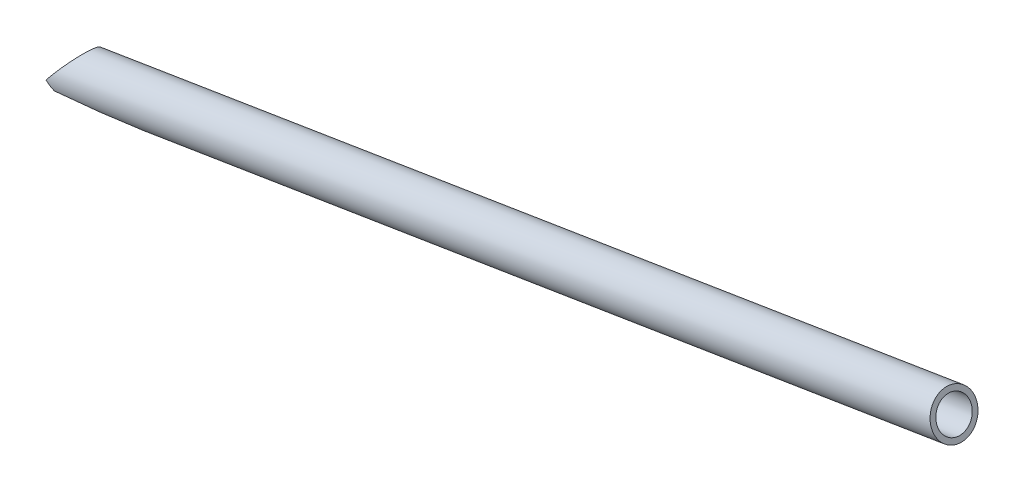
ISO-10303-21;
HEADER;
FILE_DESCRIPTION(('STEP AP214'),'2;1');
FILE_NAME('part.step','',(''),(''),'','','');
FILE_SCHEMA(('AUTOMOTIVE_DESIGN { 1 0 10303 214 1 1 1 1 }'));
ENDSEC;
DATA;
#1=APPLICATION_CONTEXT('core data for automotive mechanical design processes');
#2=APPLICATION_PROTOCOL_DEFINITION('international standard','automotive_design',2000,#1);
#3=PRODUCT_CONTEXT('',#1,'mechanical');
#4=PRODUCT('Part','Part','',(#3));
#5=PRODUCT_RELATED_PRODUCT_CATEGORY('part','',(#4));
#6=PRODUCT_DEFINITION_FORMATION('','',#4);
#7=PRODUCT_DEFINITION_CONTEXT('part definition',#1,'design');
#8=PRODUCT_DEFINITION('design','',#6,#7);
#9=PRODUCT_DEFINITION_SHAPE('','',#8);
#10=(LENGTH_UNIT() NAMED_UNIT(*) SI_UNIT(.MILLI.,.METRE.));
#11=(NAMED_UNIT(*) PLANE_ANGLE_UNIT() SI_UNIT($,.RADIAN.));
#12=(NAMED_UNIT(*) SI_UNIT($,.STERADIAN.) SOLID_ANGLE_UNIT());
#13=UNCERTAINTY_MEASURE_WITH_UNIT(LENGTH_MEASURE(1.E-05),#10,'distance_accuracy_value','');
#14=(GEOMETRIC_REPRESENTATION_CONTEXT(3) GLOBAL_UNCERTAINTY_ASSIGNED_CONTEXT((#13)) GLOBAL_UNIT_ASSIGNED_CONTEXT((#10,
#11,#12)) REPRESENTATION_CONTEXT('',''));
#15=CARTESIAN_POINT('',(0.,0.,0.));
#16=DIRECTION('',(0.,0.,1.));
#17=DIRECTION('',(1.,0.,0.));
#18=AXIS2_PLACEMENT_3D('',#15,#16,#17);
#19=CARTESIAN_POINT('',(1.11022302462516E-13,0.,200.));
#20=DIRECTION('',(0.974346253790714,0.214414809831036,0.0683788494281786));
#21=DIRECTION('',(-0.214917840654041,0.976632132263016,0.));
#22=AXIS2_PLACEMENT_3D('',#19,#20,#21);
#23=CYLINDRICAL_SURFACE('',#22,9.64999999999999);
#24=CARTESIAN_POINT('',(12.657848165168,12.6663837757625,201.033866445705));
#25=CARTESIAN_POINT('',(12.6754852969952,12.670267892202,200.817962669183));
#26=CARTESIAN_POINT('',(12.687592032191,12.6654475263971,200.601479552875));
#27=CARTESIAN_POINT('',(12.7007141875833,12.638523414575,200.169174249629));
#28=CARTESIAN_POINT('',(12.7017259689614,12.6164140008057,199.953352302735));
#29=CARTESIAN_POINT('',(12.6928978972254,12.5553665255426,199.524078278938));
#30=CARTESIAN_POINT('',(12.6830448100684,12.5164079759855,199.310629412783));
#31=CARTESIAN_POINT('',(12.6530021284405,12.4224960842971,198.888058418631));
#32=CARTESIAN_POINT('',(12.6328130614765,12.3675435584958,198.678936070393));
#33=CARTESIAN_POINT('',(12.5830320600362,12.243184894706,198.268006854536));
#34=CARTESIAN_POINT('',(12.5535148210002,12.1738950347901,198.066155597168));
#35=CARTESIAN_POINT('',(12.4858919172012,12.0217614179797,197.669092329484));
#36=CARTESIAN_POINT('',(12.447782977421,11.9389124958994,197.473882883662));
#37=CARTESIAN_POINT('',(12.3219341907085,11.6717883085674,196.89946271389));
#38=CARTESIAN_POINT('',(12.2226442596147,11.468867642128,196.531241749801));
#39=CARTESIAN_POINT('',(12.0316060655805,11.0842553958153,195.925453749268));
#40=CARTESIAN_POINT('',(11.9453209343831,10.91212601697,195.679846866211));
#41=CARTESIAN_POINT('',(11.7633134569783,10.5493905147042,195.206391270707));
#42=CARTESIAN_POINT('',(11.6675910839366,10.3587843387457,194.978542608757));
#43=CARTESIAN_POINT('',(11.4690610515366,9.96101997894277,194.540268125786));
#44=CARTESIAN_POINT('',(11.3662391268434,9.75382832807187,194.329879370938));
#45=CARTESIAN_POINT('',(11.1561166203957,9.32502507307062,193.926888893094));
#46=CARTESIAN_POINT('',(11.0488165553767,9.10341513103559,193.734285126072));
#47=CARTESIAN_POINT('',(10.8289801630034,8.64046845812747,193.361372645541));
#48=CARTESIAN_POINT('',(10.7163820687469,8.39874712577531,193.181578732136));
#49=CARTESIAN_POINT('',(10.4916151560703,7.90231270031796,192.840551125452));
#50=CARTESIAN_POINT('',(10.3794463991996,7.64759781431844,192.67932000358));
#51=CARTESIAN_POINT('',(10.1585685259634,7.12595405745613,192.375783109446));
#52=CARTESIAN_POINT('',(10.0498570573465,6.85903380588485,192.233464250728));
#53=CARTESIAN_POINT('',(9.83922076496434,6.31316264002374,191.968289535191));
#54=CARTESIAN_POINT('',(9.73729399139708,6.03421522043333,191.845428072539));
#55=CARTESIAN_POINT('',(9.57047290019094,5.54167367208223,191.650883437746));
#56=CARTESIAN_POINT('',(9.50303018067841,5.33086341131199,191.57435553236));
#57=CARTESIAN_POINT('',(9.37581635364825,4.90317076918427,191.433023906388));
#58=CARTESIAN_POINT('',(9.31604509781582,4.68628850531749,191.368219959128));
#59=CARTESIAN_POINT('',(9.15160880875329,4.02730802877123,191.192962312236));
#60=CARTESIAN_POINT('',(9.06144948682961,3.57583876087093,191.101244616923));
#61=CARTESIAN_POINT('',(8.97577033685186,2.93201498308204,191.015197637156));
#62=CARTESIAN_POINT('',(8.95588857677276,2.74596800194406,190.995420446076));
#63=CARTESIAN_POINT('',(8.92662025858535,2.37226878285702,190.966401216281));
#64=CARTESIAN_POINT('',(8.91722787463907,2.18461749436526,190.957153329495));
#65=CARTESIAN_POINT('',(8.9097824107179,1.80905100842609,190.949817507622));
#66=CARTESIAN_POINT('',(8.91171782718196,1.6211362723883,190.951718250927));
#67=CARTESIAN_POINT('',(8.92731018355185,1.24625414074607,190.967101487222));
#68=CARTESIAN_POINT('',(8.94096712902547,1.05928674559166,190.980583985713));
#69=CARTESIAN_POINT('',(8.97991455492612,0.687489382956031,191.01936046835));
#70=CARTESIAN_POINT('',(9.00522424573735,0.502663463668033,191.044673957779));
#71=CARTESIAN_POINT('',(9.06681305387757,0.136872736743957,191.10703570765));
#72=CARTESIAN_POINT('',(9.1030922202112,-0.0440920536391802,191.144084020517));
#73=CARTESIAN_POINT('',(9.18555958718107,-0.401254556927476,191.229651059047));
#74=CARTESIAN_POINT('',(9.23176218203105,-0.577444921801709,191.278186457591));
#75=CARTESIAN_POINT('',(9.33263534026653,-0.923960892723459,191.38621015946));
#76=CARTESIAN_POINT('',(9.38730810309086,-1.09428496139519,191.445701308411));
#77=CARTESIAN_POINT('',(9.52087381528293,-1.4782069213988,191.594307053623));
#78=CARTESIAN_POINT('',(9.60213445933264,-1.68961151358125,191.686970030302));
#79=CARTESIAN_POINT('',(9.77298568619439,-2.10101241056311,191.888514167262));
#80=CARTESIAN_POINT('',(9.86257895681247,-2.30100500046087,191.997400567503));
#81=CARTESIAN_POINT('',(10.0471440872052,-2.68964539689294,192.230379286382));
#82=CARTESIAN_POINT('',(10.1421222750033,-2.87827929544429,192.35448970323));
#83=CARTESIAN_POINT('',(10.3346687900217,-3.24398655328794,192.616836779603));
#84=CARTESIAN_POINT('',(10.432236937378,-3.42106071242621,192.755072460068));
#85=CARTESIAN_POINT('',(10.6302469377256,-3.76832748768761,193.048738097051));
#86=CARTESIAN_POINT('',(10.7306961138509,-3.93821118703156,193.204527959343));
#87=CARTESIAN_POINT('',(10.9296761212004,-4.26593746353563,193.529414802733));
#88=CARTESIAN_POINT('',(11.0282069546279,-4.42378005452549,193.698511768547));
#89=CARTESIAN_POINT('',(11.221393921876,-4.72732273014252,194.049334917178));
#90=CARTESIAN_POINT('',(11.3160502341815,-4.87302337442551,194.231060517198));
#91=CARTESIAN_POINT('',(11.4997202170597,-5.15204586566136,194.6064747587));
#92=CARTESIAN_POINT('',(11.5887337870685,-5.28536749201734,194.800163613268));
#93=CARTESIAN_POINT('',(11.7745249052481,-5.56162127137581,195.233914899582));
#94=CARTESIAN_POINT('',(11.8699109411979,-5.70211401694958,195.476138738318));
#95=CARTESIAN_POINT('',(12.048162615045,-5.96464239802318,195.974840419486));
#96=CARTESIAN_POINT('',(12.1310267599506,-6.08667583261123,196.231319956655));
#97=CARTESIAN_POINT('',(12.2819546322827,-6.31124777852025,196.756808713));
#98=CARTESIAN_POINT('',(12.35002236117,-6.41379155957007,197.025814520688));
#99=CARTESIAN_POINT('',(12.4693686655423,-6.59834253262544,197.574386494805));
#100=CARTESIAN_POINT('',(12.5206497605536,-6.68035280609528,197.853951069424));
#101=CARTESIAN_POINT('',(12.6010833501426,-6.81660628665564,198.396496064464));
#102=CARTESIAN_POINT('',(12.6317752082778,-6.87264686504241,198.65879763247));
#103=CARTESIAN_POINT('',(12.6768028120194,-6.96610068542239,199.188093314851));
#104=CARTESIAN_POINT('',(12.6911393670858,-7.00351484922619,199.455087196329));
#105=CARTESIAN_POINT('',(12.7028257800838,-7.05920581180806,199.991257529388));
#106=CARTESIAN_POINT('',(12.7001870149056,-7.07749541834401,200.260432398458));
#107=CARTESIAN_POINT('',(12.6777224541967,-7.09472605759301,200.798676180139));
#108=CARTESIAN_POINT('',(12.6578980603119,-7.09366866808983,201.067745099601));
#109=CARTESIAN_POINT('',(12.6043015208981,-7.07337718559519,201.574620264416));
#110=CARTESIAN_POINT('',(12.5722488163337,-7.05610016870809,201.812690956057));
#111=CARTESIAN_POINT('',(12.4950285866947,-7.0063320831581,202.285064966595));
#112=CARTESIAN_POINT('',(12.4498622194777,-6.97384235753062,202.519368616172));
#113=CARTESIAN_POINT('',(12.3470733567039,-6.89399113972104,202.982629751483));
#114=CARTESIAN_POINT('',(12.2894511612864,-6.84663000587242,203.211587365888));
#115=CARTESIAN_POINT('',(12.1626131988353,-6.73749471041387,203.662752495432));
#116=CARTESIAN_POINT('',(12.0933969981372,-6.67572000964217,203.884959757711));
#117=CARTESIAN_POINT('',(11.9436778465763,-6.53762710135798,204.323513792904));
#118=CARTESIAN_POINT('',(11.8630714479886,-6.46117299157532,204.539782321164));
#119=CARTESIAN_POINT('',(11.692289550137,-6.29471221418746,204.963110304137));
#120=CARTESIAN_POINT('',(11.6021140777158,-6.20470558459893,205.170169784681));
#121=CARTESIAN_POINT('',(11.4134646716672,-6.01169492196573,205.574276913209));
#122=CARTESIAN_POINT('',(11.3149883085275,-5.90868707929612,205.771321602816));
#123=CARTESIAN_POINT('',(11.1111357691073,-5.69022619477957,206.154656715818));
#124=CARTESIAN_POINT('',(11.0057589196984,-5.57477193809845,206.340946086708));
#125=CARTESIAN_POINT('',(10.7777141657784,-5.31856774651254,206.722010309178));
#126=CARTESIAN_POINT('',(10.6544168322438,-5.17643226006651,206.915478172531));
#127=CARTESIAN_POINT('',(10.4032278554856,-4.87788113941168,207.28788763306));
#128=CARTESIAN_POINT('',(10.2753357011349,-4.72146391350242,207.466827606892));
#129=CARTESIAN_POINT('',(10.0171562660308,-4.39453630523217,207.809780975575));
#130=CARTESIAN_POINT('',(9.88686728586113,-4.2240155980851,207.973783247038));
#131=CARTESIAN_POINT('',(9.62652996395328,-3.86910352104385,208.286208382021));
#132=CARTESIAN_POINT('',(9.49648159627687,-3.68471374773046,208.434633034108));
#133=CARTESIAN_POINT('',(9.25361789511525,-3.32302093532176,208.699957780578));
#134=CARTESIAN_POINT('',(9.14047787128656,-3.14716168728862,208.81852989279));
#135=CARTESIAN_POINT('',(8.91901082493826,-2.78429490902679,209.042457426952));
#136=CARTESIAN_POINT('',(8.81068394129518,-2.59728705748459,209.147812467701));
#137=CARTESIAN_POINT('',(8.60171787932793,-2.21240262403463,209.344571447791));
#138=CARTESIAN_POINT('',(8.50106667414862,-2.01454391683933,209.435997446312));
#139=CARTESIAN_POINT('',(8.31033157004587,-1.60787973124984,209.604404048217));
#140=CARTESIAN_POINT('',(8.22024453856257,-1.3990775246041,209.681388937858));
#141=CARTESIAN_POINT('',(8.07219799572401,-1.01814953533025,209.804936372095));
#142=CARTESIAN_POINT('',(8.01152738662136,-0.848036954497815,209.854467253069));
#143=CARTESIAN_POINT('',(7.90019825042097,-0.502123554917211,209.943941452427));
#144=CARTESIAN_POINT('',(7.84953721424909,-0.326324174555271,209.983887174039));
#145=CARTESIAN_POINT('',(7.75968346630133,0.0298789983831765,210.053882904637));
#146=CARTESIAN_POINT('',(7.7204761110397,0.210276588312629,210.083945555312));
#147=CARTESIAN_POINT('',(7.65452056150057,0.574711547408665,210.134102751716));
#148=CARTESIAN_POINT('',(7.62777240264866,0.758748926922818,210.154197269102));
#149=CARTESIAN_POINT('',(7.58729736710546,1.12933701155678,210.184476530198));
#150=CARTESIAN_POINT('',(7.57359003057456,1.31589106480192,210.194646403566));
#151=CARTESIAN_POINT('',(7.55928496846903,1.68976150279357,210.205257868046));
#152=CARTESIAN_POINT('',(7.55868719735125,1.87707788488945,210.205699492955));
#153=CARTESIAN_POINT('',(7.57007812713593,2.25126812774638,210.197252738259));
#154=CARTESIAN_POINT('',(7.58207838098105,2.43814142453817,210.188355794777));
#155=CARTESIAN_POINT('',(7.61773354362025,2.81021036406976,210.161723258219));
#156=CARTESIAN_POINT('',(7.64139531066782,2.99540495419567,210.143982463916));
#157=CARTESIAN_POINT('',(7.71032373626974,3.43413181077307,210.091751442174));
#158=CARTESIAN_POINT('',(7.76040396532063,3.68645830062254,210.053439615003));
#159=CARTESIAN_POINT('',(7.87712333147059,4.1844542800869,209.962247733673));
#160=CARTESIAN_POINT('',(7.94376372615572,4.43012326255573,209.909366573079));
#161=CARTESIAN_POINT('',(8.09048153877835,4.91483857610279,209.789947598085));
#162=CARTESIAN_POINT('',(8.17059998894754,5.15386200490303,209.723367937953));
#163=CARTESIAN_POINT('',(8.34116361501561,5.62413483013557,209.577452321735));
#164=CARTESIAN_POINT('',(8.43160870112228,5.85538429414147,209.498116476565));
#165=CARTESIAN_POINT('',(8.66224985763888,6.41106151823796,209.289197596));
#166=CARTESIAN_POINT('',(8.80669543990857,6.73123636832925,209.152951333516));
#167=CARTESIAN_POINT('',(9.10574976650321,7.35491620776174,208.855499648973));
#168=CARTESIAN_POINT('',(9.26036331945248,7.65841318346253,208.694282368093));
#169=CARTESIAN_POINT('',(9.57466628494203,8.24772414482963,208.34689305478));
#170=CARTESIAN_POINT('',(9.73435274415617,8.53354814371304,208.16073534609));
#171=CARTESIAN_POINT('',(10.0545253322407,9.08619591870411,207.762841654706));
#172=CARTESIAN_POINT('',(10.2150110783647,9.35302799910387,207.551116961846));
#173=CARTESIAN_POINT('',(10.4931035163631,9.80155444800179,207.157339786608));
#174=CARTESIAN_POINT('',(10.611422455241,9.98788573232563,206.981055422251));
#175=CARTESIAN_POINT('',(10.8444945432767,10.3472860038503,206.613194308935));
#176=CARTESIAN_POINT('',(10.9592477346205,10.5203551479894,206.421617740993));
#177=CARTESIAN_POINT('',(11.1831567308115,10.8512977391196,206.02321751645));
#178=CARTESIAN_POINT('',(11.2923203442298,11.0091926707726,205.816416171779));
#179=CARTESIAN_POINT('',(11.5031998383121,11.3079908568909,205.387344787793));
#180=CARTESIAN_POINT('',(11.6049184595258,11.4489003762788,205.165080499853));
#181=CARTESIAN_POINT('',(11.7768359798297,11.6816923565197,204.757456260285));
#182=CARTESIAN_POINT('',(11.8489604874108,11.7774553331454,204.575119144998));
#183=CARTESIAN_POINT('',(11.9863896171809,11.9561724531027,204.201901159135));
#184=CARTESIAN_POINT('',(12.0516980845563,12.0391338310809,204.011025193433));
#185=CARTESIAN_POINT('',(12.1743843772026,12.1909637141055,203.621597467278));
#186=CARTESIAN_POINT('',(12.231773473511,12.2598523164121,203.423057141255));
#187=CARTESIAN_POINT('',(12.3376871344589,12.3824764680831,203.019116826723));
#188=CARTESIAN_POINT('',(12.3862146464146,12.4362170588403,202.813719145917));
#189=CARTESIAN_POINT('',(12.4834127196024,12.5378845454177,202.349994413075));
#190=CARTESIAN_POINT('',(12.5296171657237,12.5817252761047,202.090232671769));
#191=CARTESIAN_POINT('',(12.605966980083,12.6435840389845,201.565230314472));
#192=CARTESIAN_POINT('',(12.6361087155118,12.6615962312443,201.299988473157));
#193=CARTESIAN_POINT('',(12.657848165168,12.6663837757625,201.033866445705));
#194=B_SPLINE_CURVE_WITH_KNOTS('',3,(#24,#25,#26,#27,#28,#29,#30,#31,#32,#33,#34,#35,#36,#37,
#38,#39,#40,#41,#42,#43,#44,#45,#46,#47,#48,#49,#50,#51,#52,#53,#54,#55,#56,#57,#58,#59,#60,#61,
#62,#63,#64,#65,#66,#67,#68,#69,#70,#71,#72,#73,#74,#75,#76,#77,#78,#79,#80,#81,#82,#83,#84,#85,
#86,#87,#88,#89,#90,#91,#92,#93,#94,#95,#96,#97,#98,#99,#100,#101,#102,#103,#104,#105,#106,#107,
#108,#109,#110,#111,#112,#113,#114,#115,#116,#117,#118,#119,#120,#121,#122,#123,#124,#125,#126,
#127,#128,#129,#130,#131,#132,#133,#134,#135,#136,#137,#138,#139,#140,#141,#142,#143,#144,#145,
#146,#147,#148,#149,#150,#151,#152,#153,#154,#155,#156,#157,#158,#159,#160,#161,#162,#163,#164,
#165,#166,#167,#168,#169,#170,#171,#172,#173,#174,#175,#176,#177,#178,#179,#180,#181,#182,#183,
#184,#185,#186,#187,#188,#189,#190,#191,#192,#193),.UNSPECIFIED.,.T.,.F.,(4,2,2,2,2,2,2,2,2,2,2,
2,2,2,2,2,2,2,2,2,2,2,2,2,2,2,2,2,2,2,2,2,2,2,2,2,2,2,2,2,2,2,2,2,2,2,2,2,2,2,2,2,2,2,2,2,2,2,2,
2,2,2,2,2,2,2,2,2,2,2,2,2,2,2,2,2,2,2,2,2,2,2,2,2,4),(0.,0.649678992547228,1.29957105431823,
1.95025559778301,2.60090693623045,3.24647484049866,3.8922892421184,5.18323403228391,
6.11839408192941,7.05355679074251,7.99065653809302,8.92764845027619,9.89166374666569,
10.8558124228479,11.8192904374071,12.7824903591283,13.4845685095807,14.1866330844921,
15.5872517432656,16.1512443575714,16.7149235722867,17.2780304612016,17.8411376175953,
18.4051764388978,18.9692177800052,19.5340828721208,20.0990948887177,20.8321251409705,
21.5653926679852,22.2995405038224,23.0336374882595,23.7872874320547,24.5409365102368,
25.2945508314175,26.048178579598,26.9344668093368,27.820860628459,28.7070144371056,
29.5930351807991,30.4018162261614,31.2105572414324,32.0187562935107,32.8268894357359,
33.5485495749332,34.2701460152548,34.9917250697092,35.7133311202733,36.4419715064427,
37.1706098487146,37.8994621949661,38.6283857454848,39.4371826220439,40.2460697493337,
41.0555543738144,41.8649459541521,42.5854928993547,43.3060606214649,44.0254750579606,
44.744675626512,45.3059654547501,45.8671144068969,46.4275427606506,46.9879727078769,
47.5492410779597,48.1105074981735,48.6722890743507,49.2344014349021,50.0134203547476,
50.7924984517109,51.5739927599809,52.3554802735155,53.4842022198906,54.6134618530179,
55.7420756899369,56.8701929650849,57.7169724226869,58.5637418583223,59.4092941505477,
60.2545336075759,60.9086048036489,61.5623049958734,62.2150650133965,62.8676075293849,
63.6682179517075,64.4690093666343),.UNSPECIFIED.);
#195=CARTESIAN_POINT('',(12.1046465312167,12.1046465312168,203.842854714181));
#196=VERTEX_POINT('',#195);
#197=CARTESIAN_POINT('',(12.6676672933684,12.6676672933683,200.905651889264));
#198=VERTEX_POINT('',#197);
#199=EDGE_CURVE('E118',#196,#198,#194,.T.);
#200=ORIENTED_EDGE('',*,*,#199,.T.);
#201=CARTESIAN_POINT('',(12.620043989875,12.6580645822266,201.031213378585));
#202=CARTESIAN_POINT('',(12.7011049108782,12.6759016546251,200.812254118165));
#203=CARTESIAN_POINT('',(12.7914335437327,12.687769201916,200.596224647645));
#204=CARTESIAN_POINT('',(12.9898665766632,12.70060598483,200.172153765622));
#205=CARTESIAN_POINT('',(13.0979731689363,12.7015738753942,199.964113343154));
#206=CARTESIAN_POINT('',(13.3310116553986,12.6939256763454,199.557762682774));
#207=CARTESIAN_POINT('',(13.4559511701165,12.6853052330426,199.359456907692));
#208=CARTESIAN_POINT('',(13.7213853969213,12.6599718973868,198.974131623141));
#209=CARTESIAN_POINT('',(13.8618798377827,12.6432591461194,198.787111916967));
#210=CARTESIAN_POINT('',(14.1558258223762,12.6034798585235,198.42682068598));
#211=CARTESIAN_POINT('',(14.3091643981065,12.5804653612168,198.253450919068));
#212=CARTESIAN_POINT('',(14.6282879120923,12.5295412257372,197.919334790823));
#213=CARTESIAN_POINT('',(14.7940749615075,12.5016307561701,197.758590580183));
#214=CARTESIAN_POINT('',(15.1365153772848,12.4423398192595,197.449924057493));
#215=CARTESIAN_POINT('',(15.3131669132212,12.4109599357288,197.301999595661));
#216=CARTESIAN_POINT('',(15.6758690778789,12.3459751212025,197.018725223121));
#217=CARTESIAN_POINT('',(15.8619208063878,12.3123699297107,196.883376789046));
#218=CARTESIAN_POINT('',(16.3669622671071,12.2215492114273,196.539795680015));
#219=CARTESIAN_POINT('',(16.6929775468031,12.1633283877218,196.342106418799));
#220=CARTESIAN_POINT('',(17.3614988574842,12.0474048314355,195.976721993107));
#221=CARTESIAN_POINT('',(17.7040156224495,11.9897024658632,195.809046695959));
#222=CARTESIAN_POINT('',(18.4019417397982,11.8770053187344,195.499563329936));
#223=CARTESIAN_POINT('',(18.7573812885607,11.8220176951014,195.357821229533));
#224=CARTESIAN_POINT('',(19.2969860265838,11.742690852784,195.162221674115));
#225=CARTESIAN_POINT('',(19.4779137841571,11.7167762835371,195.099861727722));
#226=CARTESIAN_POINT('',(19.8416496874136,11.6660787451101,194.980355476696));
#227=CARTESIAN_POINT('',(20.0244578767474,11.6412958022716,194.923209293396));
#228=CARTESIAN_POINT('',(20.4669346012247,11.5830171428112,194.791271829278));
#229=CARTESIAN_POINT('',(20.7273884823323,11.5501147787187,194.718851267627));
#230=CARTESIAN_POINT('',(21.2508161905557,11.4867850439317,194.582492435687));
#231=CARTESIAN_POINT('',(21.5137903064362,11.4563579607344,194.518555150166));
#232=CARTESIAN_POINT('',(22.3059012096734,11.3687987235344,194.33797605011));
#233=CARTESIAN_POINT('',(22.8380413060767,11.3154129306822,194.232620587775));
#234=CARTESIAN_POINT('',(23.9083522653449,11.2180903387045,194.045552342472));
#235=CARTESIAN_POINT('',(24.4465335603296,11.1741739103364,193.963890401862));
#236=CARTESIAN_POINT('',(25.5259509626393,11.0950921227115,193.819735733581));
#237=CARTESIAN_POINT('',(26.0671864792065,11.0599251266945,193.757239420078));
#238=CARTESIAN_POINT('',(27.1568046259864,10.9971078886399,193.647233819924));
#239=CARTESIAN_POINT('',(27.7052062009246,10.9695325055586,193.599873095669));
#240=CARTESIAN_POINT('',(28.803280363578,10.9214120830822,193.518102800346));
#241=CARTESIAN_POINT('',(29.3529530019692,10.9008673290313,193.48369375493));
#242=CARTESIAN_POINT('',(30.4521597252462,10.8659805274535,193.425686151952));
#243=CARTESIAN_POINT('',(31.0016925955854,10.8516284987607,193.402070194895));
#244=CARTESIAN_POINT('',(31.8262867087074,10.8341472031244,193.3734345105));
#245=CARTESIAN_POINT('',(32.1011955943554,10.8289946188342,193.365020747966));
#246=CARTESIAN_POINT('',(32.6510907105645,10.8199531419688,193.350286524879));
#247=CARTESIAN_POINT('',(32.9260769412089,10.8160642507578,193.343966066585));
#248=CARTESIAN_POINT('',(33.8274299709977,10.8052535340101,193.326416646981));
#249=CARTESIAN_POINT('',(34.4539084471166,10.800803785453,193.319232028569));
#250=CARTESIAN_POINT('',(35.7069286245605,10.7971699974182,193.313362520485));
#251=CARTESIAN_POINT('',(36.3334703273266,10.7979861410617,193.314677926401));
#252=CARTESIAN_POINT('',(37.5865422582679,10.8041540264702,193.324650676474));
#253=CARTESIAN_POINT('',(38.2130724765071,10.8095062993711,193.3333088804));
#254=CARTESIAN_POINT('',(39.4659697149193,10.8241207724621,193.357063787348));
#255=CARTESIAN_POINT('',(40.0923367326504,10.833383028132,193.372160581729));
#256=CARTESIAN_POINT('',(41.3452212377135,10.8552856696738,193.408094711351));
#257=CARTESIAN_POINT('',(41.9717385894931,10.8679280810037,193.428935488735));
#258=CARTESIAN_POINT('',(43.2245154949822,10.8961264719018,193.475800885791));
#259=CARTESIAN_POINT('',(43.8507750466388,10.9116824742382,193.501825545973));
#260=CARTESIAN_POINT('',(45.7290410757312,10.9620996848237,193.586987537786));
#261=CARTESIAN_POINT('',(46.9806293738712,11.000711875698,193.65321573404));
#262=CARTESIAN_POINT('',(49.488866681828,11.0854972291692,193.802488047415));
#263=CARTESIAN_POINT('',(50.7455093792145,11.1317075429858,193.885615290168));
#264=CARTESIAN_POINT('',(53.2575065341837,11.2294623930587,194.067058070909));
#265=CARTESIAN_POINT('',(54.5128609703912,11.2810070164226,194.165373856935));
#266=CARTESIAN_POINT('',(57.0213089495712,11.3876841382525,194.37642203733));
#267=CARTESIAN_POINT('',(58.2744034622621,11.4428140836502,194.489144227088));
#268=CARTESIAN_POINT('',(60.7791004298145,11.5552442672746,194.728958346723));
#269=CARTESIAN_POINT('',(62.0307029068714,11.6125444727906,194.856050060076));
#270=CARTESIAN_POINT('',(64.5162620623405,11.7272722390065,195.123323260433));
#271=CARTESIAN_POINT('',(65.7502394878734,11.7846887752327,195.263316311444));
#272=CARTESIAN_POINT('',(68.2164221945584,11.8991618836708,195.558709076989));
#273=CARTESIAN_POINT('',(69.448627403064,11.9562184414338,195.714109405807));
#274=CARTESIAN_POINT('',(71.9128542946784,12.06880183938,196.042202061149));
#275=CARTESIAN_POINT('',(73.1448724189605,12.124326040321,196.214922104081));
#276=CARTESIAN_POINT('',(75.6060086894885,12.2323104801192,196.579922978919));
#277=CARTESIAN_POINT('',(76.8351271928523,12.2847711174665,196.772201257844));
#278=CARTESIAN_POINT('',(78.6714647889444,12.3596077793001,197.07751932193));
#279=CARTESIAN_POINT('',(79.2800882229205,12.3838273601087,197.181687495984));
#280=CARTESIAN_POINT('',(80.4962436084782,12.4307698564265,197.396526360655));
#281=CARTESIAN_POINT('',(81.103775568745,12.4534927838968,197.507196999294));
#282=CARTESIAN_POINT('',(82.3178420156585,12.4971082490062,197.735964964401));
#283=CARTESIAN_POINT('',(82.9243758071853,12.5179998149018,197.85406617722));
#284=CARTESIAN_POINT('',(84.1357862476589,12.5574978531028,198.098784613669));
#285=CARTESIAN_POINT('',(84.7406629434838,12.5761043907165,198.225401593749));
#286=CARTESIAN_POINT('',(85.9467426284785,12.6104112100736,198.488349491287));
#287=CARTESIAN_POINT('',(86.5479510853667,12.6261189494415,198.624654196361));
#288=CARTESIAN_POINT('',(87.7475528850386,12.6538956106294,198.909405041617));
#289=CARTESIAN_POINT('',(88.3459463623266,12.6659647080844,199.057850595327));
#290=CARTESIAN_POINT('',(89.5383961259025,12.6853253375005,199.369860371109));
#291=CARTESIAN_POINT('',(90.1324555689776,12.6926207827083,199.533412083925));
#292=CARTESIAN_POINT('',(91.0190607766114,12.6986207468649,199.793864821244));
#293=CARTESIAN_POINT('',(91.3138169635793,12.6997970072657,199.883192809648));
#294=CARTESIAN_POINT('',(91.9014438977332,12.7001557855584,200.067836403176));
#295=CARTESIAN_POINT('',(92.1943147686565,12.6993384356608,200.163151610835));
#296=CARTESIAN_POINT('',(92.6320237622012,12.6962724103193,200.311625761075));
#297=CARTESIAN_POINT('',(92.7777876525651,12.6949417587811,200.362080696488));
#298=CARTESIAN_POINT('',(93.0686058920459,12.6915884535534,200.465012876613));
#299=CARTESIAN_POINT('',(93.2136601846536,12.6895657456329,200.517490279524));
#300=CARTESIAN_POINT('',(93.503011924647,12.684738794633,200.624730847925));
#301=CARTESIAN_POINT('',(93.6473088620541,12.6819340803061,200.679495374694));
#302=CARTESIAN_POINT('',(93.9348789972121,12.6754307640026,200.791575045197));
#303=CARTESIAN_POINT('',(94.0781522154095,12.6717321799309,200.848890137823));
#304=CARTESIAN_POINT('',(94.5073158428592,12.6590756611886,201.025628169736));
#305=CARTESIAN_POINT('',(94.7914124462141,12.6485739563349,201.149428357768));
#306=CARTESIAN_POINT('',(95.2117127587467,12.6285518676322,201.346847618912));
#307=CARTESIAN_POINT('',(95.3507885674303,12.6211697568837,201.414580074814));
#308=CARTESIAN_POINT('',(95.6264402059916,12.6046728101247,201.554740857161));
#309=CARTESIAN_POINT('',(95.7630164316214,12.5955582510557,201.627168431846));
#310=CARTESIAN_POINT('',(96.0344368840197,12.5750745596217,201.778597975394));
#311=CARTESIAN_POINT('',(96.1692420738786,12.5636802647255,201.857667025861));
#312=CARTESIAN_POINT('',(96.4342722517266,12.5380975026283,202.023151571204));
#313=CARTESIAN_POINT('',(96.564491826625,12.5239058555531,202.10957536241));
#314=CARTESIAN_POINT('',(96.8169212212189,12.4919959367344,202.290953893629));
#315=CARTESIAN_POINT('',(96.9391856784697,12.4743060887794,202.385836695308));
#316=CARTESIAN_POINT('',(97.1726959382639,12.4340968288029,202.587237196131));
#317=CARTESIAN_POINT('',(97.2839711173797,12.411590831813,202.693722181876));
#318=CARTESIAN_POINT('',(97.4544746248248,12.3684173441762,202.884155519667));
#319=CARTESIAN_POINT('',(97.5187568461126,12.349596299528,202.963936491618));
#320=CARTESIAN_POINT('',(97.6351243747555,12.3082612055481,203.131148688588));
#321=CARTESIAN_POINT('',(97.6872336961368,12.2857545787975,203.218564375844));
#322=CARTESIAN_POINT('',(97.7623855107158,12.2430482504843,203.376771777749));
#323=CARTESIAN_POINT('',(97.7894691322254,12.2238038757668,203.445872851365));
#324=CARTESIAN_POINT('',(97.8315604135547,12.1831189035385,203.587058294081));
#325=CARTESIAN_POINT('',(97.8465829361038,12.1616810458887,203.659138875985));
#326=CARTESIAN_POINT('',(97.8628142933741,12.1169048866653,203.804792070157));
#327=CARTESIAN_POINT('',(97.8639399066952,12.0935559778609,203.87837103066));
#328=CARTESIAN_POINT('',(97.8520082584352,12.0458693563997,204.02404281278));
#329=CARTESIAN_POINT('',(97.8389424548066,12.0215310567045,204.09613471268));
#330=CARTESIAN_POINT('',(97.7971777809222,11.9688136319221,204.247935359032));
#331=CARTESIAN_POINT('',(97.7663203831761,11.9404083411751,204.327028372059));
#332=CARTESIAN_POINT('',(97.6915877719453,11.8842331018887,204.479018427711));
#333=CARTESIAN_POINT('',(97.6476857607839,11.8564645892297,204.551902314365));
#334=CARTESIAN_POINT('',(97.5177557517464,11.7835782014713,204.738468214255));
#335=CARTESIAN_POINT('',(97.4232792671128,11.7393823649244,204.846536075369));
#336=CARTESIAN_POINT('',(97.2191718039851,11.6539769761827,205.048449458493));
#337=CARTESIAN_POINT('',(97.1094950339208,11.6127770436799,205.142250138293));
#338=CARTESIAN_POINT('',(96.8229194321126,11.5126527347987,205.363795426324));
#339=CARTESIAN_POINT('',(96.6401630822064,11.4553498239913,205.484594098153));
#340=CARTESIAN_POINT('',(96.2632459669298,11.3449620222257,205.70941228941));
#341=CARTESIAN_POINT('',(96.0690589777352,11.2918875444297,205.813390998201));
#342=CARTESIAN_POINT('',(95.6726481935831,11.1887075732416,206.009588460149));
#343=CARTESIAN_POINT('',(95.4703842336451,11.1386211374516,206.101735319405));
#344=CARTESIAN_POINT('',(95.0615166086385,11.0410972252149,206.276475110373));
#345=CARTESIAN_POINT('',(94.8549185214327,10.9936566008038,206.359079526695));
#346=CARTESIAN_POINT('',(94.4120323780163,10.8949616548562,206.526902241723));
#347=CARTESIAN_POINT('',(94.1753054688482,10.8439880018725,206.611120537573));
#348=CARTESIAN_POINT('',(93.6988781748563,10.7441718709007,206.772128446534));
#349=CARTESIAN_POINT('',(93.4591773329169,10.6953297258866,206.848916901254));
#350=CARTESIAN_POINT('',(92.9774295764434,10.5993978123228,206.996464244595));
#351=CARTESIAN_POINT('',(92.7353813623864,10.552309093607,207.06721955266));
#352=CARTESIAN_POINT('',(92.2495628032729,10.459648919872,207.203646589532));
#353=CARTESIAN_POINT('',(92.0057923660546,10.4140775468079,207.269318044002));
#354=CARTESIAN_POINT('',(91.2712112182395,10.2790989397647,207.460199051863));
#355=CARTESIAN_POINT('',(90.7783479224967,10.191666593002,207.578912002715));
#356=CARTESIAN_POINT('',(89.7891614493681,10.0209504775621,207.803224104744));
#357=CARTESIAN_POINT('',(89.2928394518356,9.9376653662246,207.90882751686));
#358=CARTESIAN_POINT('',(88.2969660078277,9.77438309858809,208.109759977936));
#359=CARTESIAN_POINT('',(87.7974114317796,9.69438995482751,208.205076705416));
#360=CARTESIAN_POINT('',(86.79627017556,9.53727761213236,208.387179397685));
#361=CARTESIAN_POINT('',(86.294683339015,9.46015863919451,208.473964692521));
#362=CARTESIAN_POINT('',(85.2907695696067,9.30855677205944,208.640220121633));
#363=CARTESIAN_POINT('',(84.7884451930023,9.23406976867785,208.719701999985));
#364=CARTESIAN_POINT('',(83.7825572952793,9.0873327445631,208.872518156812));
#365=CARTESIAN_POINT('',(83.2789938110271,9.01508265812478,208.945852615964));
#366=CARTESIAN_POINT('',(81.7731669518959,8.8022694185814,209.156962849293));
#367=CARTESIAN_POINT('',(80.769377560363,8.66468529111102,209.286880180394));
#368=CARTESIAN_POINT('',(78.75885496789,8.39639673654941,209.530119581309));
#369=CARTESIAN_POINT('',(77.752121616114,8.26569266872079,209.643440785057));
#370=CARTESIAN_POINT('',(75.7362387061998,8.0105177176464,209.856430380045));
#371=CARTESIAN_POINT('',(74.7270887321034,7.8860480025194,209.956096218731));
#372=CARTESIAN_POINT('',(72.7070008153684,7.64301623434054,210.143858108922));
#373=CARTESIAN_POINT('',(71.6960628548628,7.52445424067272,210.231954044142));
#374=CARTESIAN_POINT('',(69.6709426521024,7.29289795523545,210.398268299002));
#375=CARTESIAN_POINT('',(68.6567578270169,7.1799137424356,210.476469110024));
#376=CARTESIAN_POINT('',(66.6271098852402,6.95976575348964,210.623992111453));
#377=CARTESIAN_POINT('',(65.6116467629009,6.85260200315397,210.693314262489));
#378=CARTESIAN_POINT('',(63.5797324297953,6.64429714943566,210.823974443731));
#379=CARTESIAN_POINT('',(62.5632813733814,6.54315522331668,210.885313565989));
#380=CARTESIAN_POINT('',(60.5293571326168,6.34722202002142,211.000713358216));
#381=CARTESIAN_POINT('',(59.5118839502824,6.25243073034249,211.054774042515));
#382=CARTESIAN_POINT('',(57.4790528945009,6.06998848065954,211.155988774439));
#383=CARTESIAN_POINT('',(56.4636978881404,5.98231686129204,211.203163147082));
#384=CARTESIAN_POINT('',(54.4320869862138,5.81450417424946,211.291169771653));
#385=CARTESIAN_POINT('',(53.4158310882352,5.73436312680208,211.332002006546));
#386=CARTESIAN_POINT('',(51.3822688142994,5.58254677781397,211.407557140682));
#387=CARTESIAN_POINT('',(50.3649622792454,5.51087303938963,211.442278912474));
#388=CARTESIAN_POINT('',(48.3295236935387,5.37726830776598,211.505670408091));
#389=CARTESIAN_POINT('',(47.3113916484584,5.31533724934354,211.534340172432));
#390=CARTESIAN_POINT('',(45.2758766097926,5.20296998202875,211.585461145656));
#391=CARTESIAN_POINT('',(44.2584948172623,5.15251650530081,211.607921707289));
#392=CARTESIAN_POINT('',(42.222984543397,5.06520139724806,211.646287392872));
#393=CARTESIAN_POINT('',(41.2048560401801,5.02834018160028,211.66219231634));
#394=CARTESIAN_POINT('',(39.1683201819901,4.97119202438807,211.686669661113));
#395=CARTESIAN_POINT('',(38.1499130048381,4.9509000668733,211.695244301525));
#396=CARTESIAN_POINT('',(36.6221617987886,4.93598156073707,211.701542550909));
#397=CARTESIAN_POINT('',(36.112902935619,4.9335951394024,211.702548082283));
#398=CARTESIAN_POINT('',(35.0943951021102,4.93466917034953,211.702095890989));
#399=CARTESIAN_POINT('',(34.5851461317439,4.93812952838279,211.700638208028));
#400=CARTESIAN_POINT('',(33.667753240756,4.95033045347805,211.695480332548));
#401=CARTESIAN_POINT('',(33.2595908096299,4.95788752248339,211.692282303181));
#402=CARTESIAN_POINT('',(32.4433972599631,4.97773174248266,211.68384804187));
#403=CARTESIAN_POINT('',(32.0353661420498,4.99001891575172,211.67861180033));
#404=CARTESIAN_POINT('',(31.219436611981,5.01986993570448,211.66581205596));
#405=CARTESIAN_POINT('',(30.8115382518148,5.03743499343352,211.658248018994));
#406=CARTESIAN_POINT('',(29.9960892441026,5.07847193609837,211.64043063466));
#407=CARTESIAN_POINT('',(29.5885386000704,5.10194388003441,211.63017726043));
#408=CARTESIAN_POINT('',(28.7739552754402,5.15552740264646,211.606523944454));
#409=CARTESIAN_POINT('',(28.3669226004864,5.18563905306157,211.593123968711));
#410=CARTESIAN_POINT('',(27.5536259859555,5.25335327553754,211.562597552429));
#411=CARTESIAN_POINT('',(27.1473620228879,5.29095561483852,211.545471227678));
#412=CARTESIAN_POINT('',(26.3360146922367,5.37463238679717,211.506757136954));
#413=CARTESIAN_POINT('',(25.930931048063,5.42070463955227,211.485170518749));
#414=CARTESIAN_POINT('',(25.1223027882863,5.52247760129933,211.436582521925));
#415=CARTESIAN_POINT('',(24.7187581211499,5.57817798494321,211.409581326267));
#416=CARTESIAN_POINT('',(23.8242575613429,5.71414231601047,211.342204393308));
#417=CARTESIAN_POINT('',(23.3338284997149,5.79711414444239,211.300189580222));
#418=CARTESIAN_POINT('',(22.357881572172,5.98221454394821,211.203308272473));
#419=CARTESIAN_POINT('',(21.8723625954961,6.08433867537005,211.148444755508));
#420=CARTESIAN_POINT('',(21.1499268879832,6.25421676090301,211.053456522373));
#421=CARTESIAN_POINT('',(20.9101894199789,6.31359599573423,211.019695324988));
#422=CARTESIAN_POINT('',(20.4330314906374,6.43834502321326,210.947279893416));
#423=CARTESIAN_POINT('',(20.1956108315234,6.50371429947613,210.908626080898));
#424=CARTESIAN_POINT('',(19.7236957671805,6.64083284680703,210.82569885273));
#425=CARTESIAN_POINT('',(19.4892003084561,6.71257974065098,210.781427528369));
#426=CARTESIAN_POINT('',(19.0237410712168,6.86285212233356,210.686400720766));
#427=CARTESIAN_POINT('',(18.7927769078838,6.94137686527769,210.63564594977));
#428=CARTESIAN_POINT('',(18.2825980994924,7.12440706020905,210.514158972853));
#429=CARTESIAN_POINT('',(18.0044822474977,7.2307378881142,210.441515634362));
#430=CARTESIAN_POINT('',(17.4567161515844,7.45455990037431,210.282915090414));
#431=CARTESIAN_POINT('',(17.1870632947051,7.57204759402103,210.196962043964));
#432=CARTESIAN_POINT('',(16.6587830712606,7.81809323181714,210.00956079859));
#433=CARTESIAN_POINT('',(16.4001423298991,7.94663713891657,209.90813212456));
#434=CARTESIAN_POINT('',(15.8963538729728,8.21436521805563,209.687326605342));
#435=CARTESIAN_POINT('',(15.6512025534872,8.35354652416614,209.567954586131));
#436=CARTESIAN_POINT('',(15.2297584503878,8.60950026858462,209.337517664505));
#437=CARTESIAN_POINT('',(15.0501934589541,8.72445499674745,209.230415649967));
#438=CARTESIAN_POINT('',(14.7027567700797,8.95901035009921,209.002934380375));
#439=CARTESIAN_POINT('',(14.5348877642779,9.07861203490916,208.882552085441));
#440=CARTESIAN_POINT('',(14.2125600800004,9.32102491531088,208.627826554129));
#441=CARTESIAN_POINT('',(14.0581009688631,9.44383600718671,208.493483768485));
#442=CARTESIAN_POINT('',(13.764255342402,9.69085682174111,208.210513668636));
#443=CARTESIAN_POINT('',(13.6248613363562,9.81506581511142,208.061893523552));
#444=CARTESIAN_POINT('',(13.3613663447195,10.0639923655048,207.748958716728));
#445=CARTESIAN_POINT('',(13.2374090128104,10.1887049406458,207.584518722046));
#446=CARTESIAN_POINT('',(13.0074835470576,10.4352931716929,207.241495640006));
#447=CARTESIAN_POINT('',(12.9015160130618,10.5571687328854,207.062912081339));
#448=CARTESIAN_POINT('',(12.7086094673899,10.7957446943769,206.692562762327));
#449=CARTESIAN_POINT('',(12.6216654056888,10.9124464615505,206.500800518239));
#450=CARTESIAN_POINT('',(12.4675217238158,11.1384967833175,206.105384551824));
#451=CARTESIAN_POINT('',(12.4003193152687,11.247846374672,205.901732513725));
#452=CARTESIAN_POINT('',(12.293888275386,11.4430276189378,205.512522960485));
#453=CARTESIAN_POINT('',(12.2521037944246,11.5300387320101,205.328249914664));
#454=CARTESIAN_POINT('',(12.1838629592017,11.6959965038584,204.953349534111));
#455=CARTESIAN_POINT('',(12.1574052966893,11.7749438504592,204.762722743185));
#456=CARTESIAN_POINT('',(12.1199413504328,11.9238631684697,204.376563108601));
#457=CARTESIAN_POINT('',(12.1089313972989,11.9938372677608,204.181031441265));
#458=CARTESIAN_POINT('',(12.1023971605705,12.1241646562768,203.786526728716));
#459=CARTESIAN_POINT('',(12.1068732091131,12.1845177391252,203.587553609783));
#460=CARTESIAN_POINT('',(12.1311181507227,12.2943761635388,203.190629183932));
#461=CARTESIAN_POINT('',(12.1506676304034,12.3440241740435,202.992703895743));
#462=CARTESIAN_POINT('',(12.2047097751951,12.433365453792,202.596657716323));
#463=CARTESIAN_POINT('',(12.2392018110862,12.4730591420936,202.398536833678));
#464=CARTESIAN_POINT('',(12.3229706752704,12.542544025653,202.003689665928));
#465=CARTESIAN_POINT('',(12.3722476196043,12.5723351431855,201.80696339178));
#466=CARTESIAN_POINT('',(12.485333457562,12.6222952461847,201.416481899456));
#467=CARTESIAN_POINT('',(12.5491437332365,12.6424633159804,201.222726965712));
#468=CARTESIAN_POINT('',(12.620043989875,12.6580645822266,201.031213378585));
#469=B_SPLINE_CURVE_WITH_KNOTS('',3,(#201,#202,#203,#204,#205,#206,#207,#208,#209,#210,#211,
#212,#213,#214,#215,#216,#217,#218,#219,#220,#221,#222,#223,#224,#225,#226,#227,#228,#229,#230,
#231,#232,#233,#234,#235,#236,#237,#238,#239,#240,#241,#242,#243,#244,#245,#246,#247,#248,#249,
#250,#251,#252,#253,#254,#255,#256,#257,#258,#259,#260,#261,#262,#263,#264,#265,#266,#267,#268,
#269,#270,#271,#272,#273,#274,#275,#276,#277,#278,#279,#280,#281,#282,#283,#284,#285,#286,#287,
#288,#289,#290,#291,#292,#293,#294,#295,#296,#297,#298,#299,#300,#301,#302,#303,#304,#305,#306,
#307,#308,#309,#310,#311,#312,#313,#314,#315,#316,#317,#318,#319,#320,#321,#322,#323,#324,#325,
#326,#327,#328,#329,#330,#331,#332,#333,#334,#335,#336,#337,#338,#339,#340,#341,#342,#343,#344,
#345,#346,#347,#348,#349,#350,#351,#352,#353,#354,#355,#356,#357,#358,#359,#360,#361,#362,#363,
#364,#365,#366,#367,#368,#369,#370,#371,#372,#373,#374,#375,#376,#377,#378,#379,#380,#381,#382,
#383,#384,#385,#386,#387,#388,#389,#390,#391,#392,#393,#394,#395,#396,#397,#398,#399,#400,#401,
#402,#403,#404,#405,#406,#407,#408,#409,#410,#411,#412,#413,#414,#415,#416,#417,#418,#419,#420,
#421,#422,#423,#424,#425,#426,#427,#428,#429,#430,#431,#432,#433,#434,#435,#436,#437,#438,#439,
#440,#441,#442,#443,#444,#445,#446,#447,#448,#449,#450,#451,#452,#453,#454,#455,#456,#457,#458,
#459,#460,#461,#462,#463,#464,#465,#466,#467,#468),.UNSPECIFIED.,.T.,.F.,(4,2,2,2,2,2,2,2,2,2,2,
2,2,2,2,2,2,2,2,2,2,2,2,2,2,2,2,2,2,2,2,2,2,2,2,2,2,2,2,2,2,2,2,2,2,2,2,2,2,2,2,2,2,2,2,2,2,2,2,
2,2,2,2,2,2,2,2,2,2,2,2,2,2,2,2,2,2,2,2,2,2,2,2,2,2,2,2,2,2,2,2,2,2,2,2,2,2,2,2,2,2,2,2,2,2,2,2,
2,2,2,2,2,2,2,2,2,2,2,2,2,2,2,2,2,2,2,2,2,2,2,2,2,2,4),(0.,0.702248194127102,1.40458304737984,
2.10723693381695,2.80987857026238,3.50688431041088,4.2040085252009,4.90101561002054,
5.5981044317661,6.75321609638337,7.90908956626371,9.06786364487061,9.64715805296323,
10.226465938762,11.0432689526149,11.8601667008898,13.4945442868132,15.1324034677028,
16.7699560227822,18.4231205326611,20.07635212974,21.7269090752914,22.5521578257543,
23.3774074670206,25.2569082432589,27.1364743794276,29.0162606246461,30.8960735435816,
32.7770154190231,34.6579719936339,38.4196016639773,42.2002029211062,45.9808659241334,
49.7588656281356,53.5368084116608,57.266378690868,60.9960977269544,64.7318836146386,
68.4671824861792,70.3209979768955,72.1747986505013,74.029577094206,75.8843025141841,
77.734187730358,79.5839836393539,81.432261254552,82.3562007373485,83.2800789488027,
83.7428303028519,84.2056179273223,84.6686850387828,85.131742875483,86.0614907187733,
86.5260222525805,86.9904795907858,87.4603782966605,87.93081427013,88.3975742291317,
88.8630506028992,89.1748393290816,89.4860076810452,89.7151663720527,89.9440422386018,
90.1742880640845,90.4046725551614,90.6717521582119,90.9393842641972,91.3874129355242,
91.8368219032029,92.5144051304492,93.193608501856,93.8767611161459,94.5590827761173,
95.3280458859198,96.0971286926001,96.8666648033282,97.6362424111065,99.1792729269831,
100.721800597501,102.266155880351,103.810632341118,105.352580115181,106.894482554422,
109.95866232043,113.023001933221,116.087913573965,119.152856016794,122.223147965553,
125.293453528194,128.363338640805,131.433217709487,134.493844390491,137.554479292339,
140.615678325873,143.676856865101,146.733398995521,149.790034593026,152.845744523109,
154.373509830402,155.901250510754,157.125957238978,158.350669734692,159.575663463629,
160.800669428758,162.025688630184,163.250669772246,164.475336081029,165.699961014704,
167.197036366655,168.693765112946,169.441494232327,170.189158952578,170.93654614401,
171.683851300942,172.602757884771,173.521377906734,174.438848387609,175.356072548993,
176.071241089239,176.786573673837,177.5018831701,178.216835345396,178.938009770248,
179.659208237064,180.380215019582,181.101119915741,181.724397125221,182.347621125796,
182.970697063048,183.593786363846,184.20797314847,184.822134072659,185.436299817278,
186.050523990547),.UNSPECIFIED.);
#470=EDGE_CURVE('E65',#198,#196,#469,.T.);
#471=ORIENTED_EDGE('',*,*,#470,.T.);
#472=EDGE_LOOP('',(#200,#471));
#473=FACE_BOUND('',#472,.T.);
#474=CARTESIAN_POINT('',(549.76326332179,120.981001464959,238.581950982591));
#475=DIRECTION('',(0.949282258198062,0.310528416732881,0.0493487251279869));
#476=DIRECTION('',(0.296210008732026,-0.935849575324635,0.190906267816626));
#477=AXIS2_PLACEMENT_3D('',#474,#475,#476);
#478=ELLIPSE('',#477,9.6996046264727,9.64999999999999);
#479=CARTESIAN_POINT('',(552.636383292895,111.903630594458,240.433666301128));
#480=VERTEX_POINT('',#479);
#481=EDGE_CURVE('E48',#480,#480,#478,.T.);
#482=ORIENTED_EDGE('',*,*,#481,.T.);
#483=EDGE_LOOP('',(#482));
#484=FACE_BOUND('',#483,.T.);
#485=ADVANCED_FACE('F44',(#473,#484),#23,.F.);
#486=CARTESIAN_POINT('',(1.11022302462516E-13,0.,200.));
#487=DIRECTION('',(0.974346253790714,0.214414809831036,0.0683788494281786));
#488=DIRECTION('',(-0.214917840654041,0.976632132263016,0.));
#489=AXIS2_PLACEMENT_3D('',#486,#487,#488);
#490=CYLINDRICAL_SURFACE('',#489,12.7);
#491=CARTESIAN_POINT('',(0.,0.,200.));
#492=DIRECTION('',(-0.11325578618615,0.946595388418475,0.301877951364842));
#493=DIRECTION('',(0.993565864397201,0.107901658820134,0.0344108286518399));
#494=AXIS2_PLACEMENT_3D('',#491,#492,#493);
#495=ELLIPSE('',#494,112.135551106643,12.7);
#496=CARTESIAN_POINT('',(11.630689573576,5.10069211412612,188.369310426424));
#497=VERTEX_POINT('',#496);
#498=CARTESIAN_POINT('',(3.47897724068397,-3.47897724068374,212.214201462183));
#499=VERTEX_POINT('',#498);
#500=EDGE_CURVE('E55',#497,#499,#495,.F.);
#501=ORIENTED_EDGE('',*,*,#500,.F.);
#502=CARTESIAN_POINT('',(0.,0.,200.));
#503=DIRECTION('',(0.66655452492401,0.146682107256602,0.73088263402142));
#504=DIRECTION('',(0.713803465298348,0.157079717475421,-0.682503168700272));
#505=AXIS2_PLACEMENT_3D('',#502,#503,#504);
#506=ELLIPSE('',#505,17.3762508627723,12.7);
#507=CARTESIAN_POINT('',(8.37083962416096,9.55086613803042,190.44913386197));
#508=VERTEX_POINT('',#507);
#509=EDGE_CURVE('E104',#508,#497,#506,.F.);
#510=ORIENTED_EDGE('',*,*,#509,.F.);
#511=CARTESIAN_POINT('',(2.22044604925031E-13,0.,200.));
#512=DIRECTION('',(0.777323286333913,-0.626731677103114,0.0545519334081296));
#513=DIRECTION('',(0.625193989957555,0.779235140965497,0.0438756197156641));
#514=AXIS2_PLACEMENT_3D('',#511,#512,#513);
#515=ELLIPSE('',#514,20.2638552732839,12.7);
#516=CARTESIAN_POINT('',(-0.889089207943894,1.52655665885959E-13,212.668840530227));
#517=VERTEX_POINT('',#516);
#518=EDGE_CURVE('E85',#517,#508,#515,.F.);
#519=ORIENTED_EDGE('',*,*,#518,.F.);
#520=CARTESIAN_POINT('',(2.22044604925031E-13,0.,200.));
#521=DIRECTION('',(0.625193989957555,0.779235140965497,0.0438756197156641));
#522=DIRECTION('',(0.777323286333913,-0.626731677103114,0.0545519334081296));
#523=AXIS2_PLACEMENT_3D('',#520,#521,#522);
#524=ELLIPSE('',#523,16.2980329458247,12.7);
#525=EDGE_CURVE('E91',#499,#517,#524,.F.);
#526=ORIENTED_EDGE('',*,*,#525,.F.);
#527=EDGE_LOOP('',(#501,#510,#519,#526));
#528=FACE_BOUND('',#527,.T.);
#529=CARTESIAN_POINT('',(549.76326332179,120.981001464959,238.581950982591));
#530=DIRECTION('',(0.949282258198062,0.310528416732881,0.0493487251279869));
#531=DIRECTION('',(0.296210008732026,-0.935849575324635,0.190906267816626));
#532=AXIS2_PLACEMENT_3D('',#529,#530,#531);
#533=ELLIPSE('',#532,12.7652827726636,12.7);
#534=CARTESIAN_POINT('',(553.544467843348,109.034617003263,241.018923474344));
#535=VERTEX_POINT('',#534);
#536=EDGE_CURVE('E11',#535,#535,#533,.T.);
#537=ORIENTED_EDGE('',*,*,#536,.F.);
#538=EDGE_LOOP('',(#537));
#539=FACE_BOUND('',#538,.T.);
#540=ADVANCED_FACE('F101',(#528,#539),#490,.T.);
#541=CARTESIAN_POINT('',(1.66533453693773E-13,0.,200.));
#542=DIRECTION('',(0.,0.,-1.));
#543=DIRECTION('',(-1.,0.,0.));
#544=AXIS2_PLACEMENT_3D('',#541,#542,#543);
#545=CYLINDRICAL_SURFACE('',#544,12.7);
#546=ORIENTED_EDGE('',*,*,#509,.T.);
#547=CARTESIAN_POINT('',(1.66533453693773E-13,0.,200.));
#548=DIRECTION('',(-0.707106781186547,0.,-0.707106781186548));
#549=DIRECTION('',(0.707106781186547,0.,-0.707106781186548));
#550=AXIS2_PLACEMENT_3D('',#547,#548,#549);
#551=ELLIPSE('',#550,17.9605122421383,12.7);
#552=CARTESIAN_POINT('',(8.98025612106912,8.9802561210691,191.019743878931));
#553=VERTEX_POINT('',#552);
#554=EDGE_CURVE('E115',#497,#553,#551,.F.);
#555=ORIENTED_EDGE('',*,*,#554,.T.);
#556=CARTESIAN_POINT('',(1.66533453693773E-13,0.,200.));
#557=DIRECTION('',(0.,0.707106781186551,0.707106781186544));
#558=DIRECTION('',(0.,0.707106781186544,-0.707106781186552));
#559=AXIS2_PLACEMENT_3D('',#556,#557,#558);
#560=ELLIPSE('',#559,17.9605122421384,12.7);
#561=EDGE_CURVE('E151',#553,#508,#560,.T.);
#562=ORIENTED_EDGE('',*,*,#561,.T.);
#563=EDGE_LOOP('',(#546,#555,#562));
#564=FACE_BOUND('',#563,.T.);
#565=ADVANCED_FACE('F133',(#564),#545,.F.);
#566=CARTESIAN_POINT('',(1.66533453693773E-13,0.,200.));
#567=DIRECTION('',(0.,1.,0.));
#568=DIRECTION('',(0.,0.,1.));
#569=AXIS2_PLACEMENT_3D('',#566,#567,#568);
#570=CYLINDRICAL_SURFACE('',#569,12.7);
#571=CARTESIAN_POINT('',(1.66533453693773E-13,0.,200.));
#572=DIRECTION('',(-0.707106781186547,0.707106781186548,0.));
#573=DIRECTION('',(0.707106781186547,0.707106781186548,0.));
#574=AXIS2_PLACEMENT_3D('',#571,#572,#573);
#575=ELLIPSE('',#574,17.9605122421383,12.7);
#576=CARTESIAN_POINT('',(1.11022302462516E-13,1.38777878078145E-13,212.7));
#577=VERTEX_POINT('',#576);
#578=EDGE_CURVE('E113',#196,#577,#575,.F.);
#579=ORIENTED_EDGE('',*,*,#578,.T.);
#580=CARTESIAN_POINT('',(1.66533453693773E-13,0.,200.));
#581=DIRECTION('',(0.707106781186547,0.707106781186548,0.));
#582=DIRECTION('',(-0.707106781186547,0.707106781186548,0.));
#583=AXIS2_PLACEMENT_3D('',#580,#581,#582);
#584=ELLIPSE('',#583,17.9605122421383,12.7);
#585=EDGE_CURVE('E95',#577,#499,#584,.T.);
#586=ORIENTED_EDGE('',*,*,#585,.T.);
#587=ORIENTED_EDGE('',*,*,#525,.T.);
#588=ORIENTED_EDGE('',*,*,#518,.T.);
#589=ORIENTED_EDGE('',*,*,#561,.F.);
#590=EDGE_CURVE('E106',#553,#198,#575,.F.);
#591=ORIENTED_EDGE('',*,*,#590,.T.);
#592=ORIENTED_EDGE('',*,*,#199,.F.);
#593=EDGE_LOOP('',(#579,#586,#587,#588,#589,#591,#592));
#594=FACE_BOUND('',#593,.T.);
#595=ADVANCED_FACE('F93',(#594),#570,.F.);
#596=CARTESIAN_POINT('',(899.999999999994,2.4980018054066E-13,200.));
#597=DIRECTION('',(-1.,0.,0.));
#598=DIRECTION('',(0.,-1.,0.));
#599=AXIS2_PLACEMENT_3D('',#596,#597,#598);
#600=CYLINDRICAL_SURFACE('',#599,12.7);
#601=ORIENTED_EDGE('',*,*,#590,.F.);
#602=ORIENTED_EDGE('',*,*,#554,.F.);
#603=ORIENTED_EDGE('',*,*,#500,.T.);
#604=ORIENTED_EDGE('',*,*,#585,.F.);
#605=ORIENTED_EDGE('',*,*,#578,.F.);
#606=ORIENTED_EDGE('',*,*,#470,.F.);
#607=EDGE_LOOP('',(#601,#602,#603,#604,#605,#606));
#608=FACE_BOUND('',#607,.T.);
#609=ADVANCED_FACE('F132',(#608),#600,.F.);
#610=CARTESIAN_POINT('',(549.76326332179,120.981001464959,238.581950982591));
#611=DIRECTION('',(0.949282258198062,0.310528416732881,0.0493487251279869));
#612=DIRECTION('',(-0.31090722316287,0.950440265658581,0.));
#613=AXIS2_PLACEMENT_3D('',#610,#611,#612);
#614=PLANE('',#613);
#615=ORIENTED_EDGE('',*,*,#481,.F.);
#616=EDGE_LOOP('',(#615));
#617=FACE_BOUND('',#616,.T.);
#618=ORIENTED_EDGE('',*,*,#536,.T.);
#619=EDGE_LOOP('',(#618));
#620=FACE_BOUND('',#619,.T.);
#621=ADVANCED_FACE('F46',(#617,#620),#614,.T.);
#622=CLOSED_SHELL('',(#485,#540,#565,#595,#609,#621));
#623=MANIFOLD_SOLID_BREP('B2',#622);
#624=ADVANCED_BREP_SHAPE_REPRESENTATION('',(#18,#623),#14);
#625=SHAPE_DEFINITION_REPRESENTATION(#9,#624);
ENDSEC;
END-ISO-10303-21;
